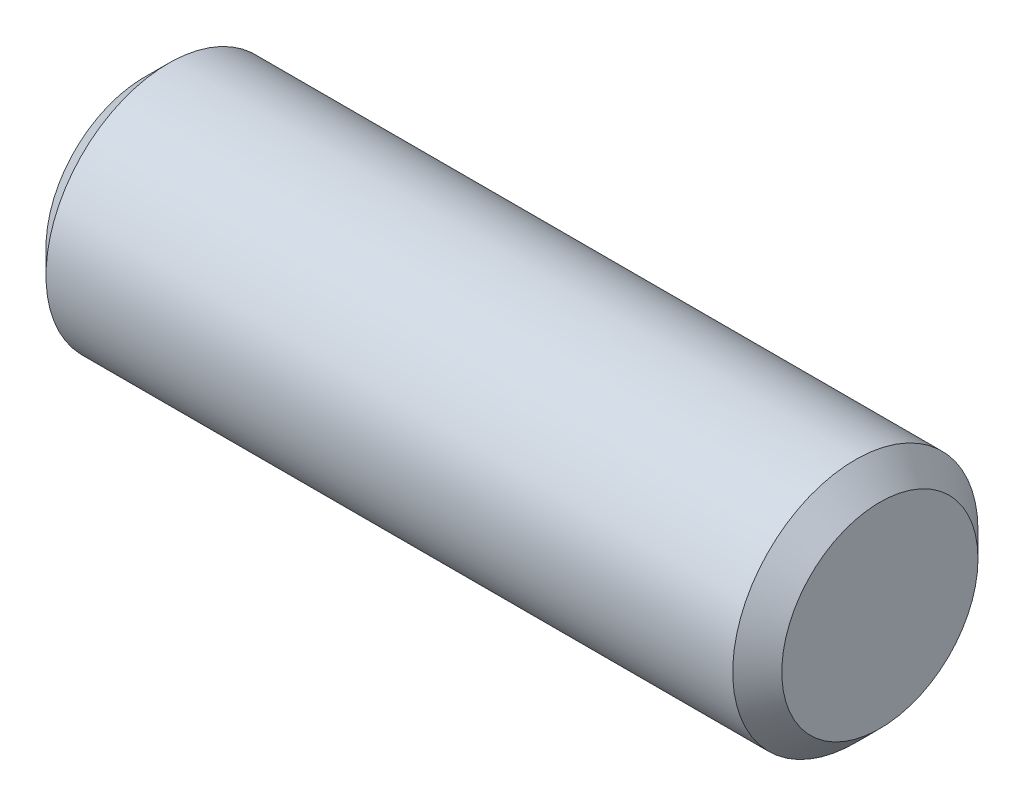
ISO-10303-21;
HEADER;
FILE_DESCRIPTION(('STEP AP214'),'2;1');
FILE_NAME('part.step','',(''),(''),'','','');
FILE_SCHEMA(('AUTOMOTIVE_DESIGN { 1 0 10303 214 1 1 1 1 }'));
ENDSEC;
DATA;
#1=APPLICATION_CONTEXT('core data for automotive mechanical design processes');
#2=APPLICATION_PROTOCOL_DEFINITION('international standard','automotive_design',2000,#1);
#3=PRODUCT_CONTEXT('',#1,'mechanical');
#4=PRODUCT('Part','Part','',(#3));
#5=PRODUCT_RELATED_PRODUCT_CATEGORY('part','',(#4));
#6=PRODUCT_DEFINITION_FORMATION('','',#4);
#7=PRODUCT_DEFINITION_CONTEXT('part definition',#1,'design');
#8=PRODUCT_DEFINITION('design','',#6,#7);
#9=PRODUCT_DEFINITION_SHAPE('','',#8);
#10=(LENGTH_UNIT() NAMED_UNIT(*) SI_UNIT(.MILLI.,.METRE.));
#11=(NAMED_UNIT(*) PLANE_ANGLE_UNIT() SI_UNIT($,.RADIAN.));
#12=(NAMED_UNIT(*) SI_UNIT($,.STERADIAN.) SOLID_ANGLE_UNIT());
#13=UNCERTAINTY_MEASURE_WITH_UNIT(LENGTH_MEASURE(1.E-05),#10,'distance_accuracy_value','');
#14=(GEOMETRIC_REPRESENTATION_CONTEXT(3) GLOBAL_UNCERTAINTY_ASSIGNED_CONTEXT((#13)) GLOBAL_UNIT_ASSIGNED_CONTEXT((#10,
#11,#12)) REPRESENTATION_CONTEXT('',''));
#15=CARTESIAN_POINT('',(0.,0.,0.));
#16=DIRECTION('',(0.,0.,1.));
#17=DIRECTION('',(1.,0.,0.));
#18=AXIS2_PLACEMENT_3D('',#15,#16,#17);
#19=CARTESIAN_POINT('',(-1.190625,0.,0.));
#20=DIRECTION('',(1.,0.,0.));
#21=DIRECTION('',(0.,0.,-1.));
#22=AXIS2_PLACEMENT_3D('',#19,#20,#21);
#23=CYLINDRICAL_SURFACE('',#22,0.396875);
#24=CARTESIAN_POINT('',(1.11125,0.,0.));
#25=DIRECTION('',(1.,0.,0.));
#26=DIRECTION('',(0.,0.,-1.));
#27=AXIS2_PLACEMENT_3D('',#24,#25,#26);
#28=CIRCLE('',#27,0.396875);
#29=CARTESIAN_POINT('',(1.11125,0.,-0.396875));
#30=VERTEX_POINT('',#29);
#31=EDGE_CURVE('E48',#30,#30,#28,.F.);
#32=ORIENTED_EDGE('',*,*,#31,.T.);
#33=EDGE_LOOP('',(#32));
#34=FACE_BOUND('',#33,.T.);
#35=CARTESIAN_POINT('',(-1.11125,0.,0.));
#36=DIRECTION('',(1.,0.,0.));
#37=DIRECTION('',(0.,0.,-1.));
#38=AXIS2_PLACEMENT_3D('',#35,#36,#37);
#39=CIRCLE('',#38,0.396875);
#40=CARTESIAN_POINT('',(-1.11125,0.,-0.396875));
#41=VERTEX_POINT('',#40);
#42=EDGE_CURVE('E53',#41,#41,#39,.T.);
#43=ORIENTED_EDGE('',*,*,#42,.T.);
#44=EDGE_LOOP('',(#43));
#45=FACE_BOUND('',#44,.T.);
#46=ADVANCED_FACE('F40',(#34,#45),#23,.T.);
#47=CARTESIAN_POINT('',(-1.190625,0.,0.));
#48=DIRECTION('',(1.,0.,0.));
#49=DIRECTION('',(0.,0.,-1.));
#50=AXIS2_PLACEMENT_3D('',#47,#48,#49);
#51=PLANE('',#50);
#52=CARTESIAN_POINT('',(-1.190625,0.,0.));
#53=DIRECTION('',(1.,0.,0.));
#54=DIRECTION('',(0.,0.,-1.));
#55=AXIS2_PLACEMENT_3D('',#52,#53,#54);
#56=CIRCLE('',#55,0.317499999999999);
#57=CARTESIAN_POINT('',(-1.190625,0.,-0.317499999999999));
#58=VERTEX_POINT('',#57);
#59=EDGE_CURVE('E10',#58,#58,#56,.F.);
#60=ORIENTED_EDGE('',*,*,#59,.T.);
#61=EDGE_LOOP('',(#60));
#62=FACE_BOUND('',#61,.T.);
#63=ADVANCED_FACE('F75',(#62),#51,.F.);
#64=CARTESIAN_POINT('',(1.190625,0.,0.));
#65=DIRECTION('',(1.,0.,0.));
#66=DIRECTION('',(0.,0.,-1.));
#67=AXIS2_PLACEMENT_3D('',#64,#65,#66);
#68=PLANE('',#67);
#69=CARTESIAN_POINT('',(1.190625,0.,0.));
#70=DIRECTION('',(1.,0.,0.));
#71=DIRECTION('',(0.,0.,-1.));
#72=AXIS2_PLACEMENT_3D('',#69,#70,#71);
#73=CIRCLE('',#72,0.317499999999999);
#74=CARTESIAN_POINT('',(1.190625,0.,-0.317499999999999));
#75=VERTEX_POINT('',#74);
#76=EDGE_CURVE('E58',#75,#75,#73,.T.);
#77=ORIENTED_EDGE('',*,*,#76,.T.);
#78=EDGE_LOOP('',(#77));
#79=FACE_BOUND('',#78,.T.);
#80=ADVANCED_FACE('F65',(#79),#68,.T.);
#81=CARTESIAN_POINT('',(1.190625,0.,0.));
#82=DIRECTION('',(-1.,0.,0.));
#83=DIRECTION('',(0.,0.,1.));
#84=AXIS2_PLACEMENT_3D('',#81,#82,#83);
#85=CONICAL_SURFACE('',#84,0.317499999999999,0.785398163397447);
#86=ORIENTED_EDGE('',*,*,#31,.F.);
#87=EDGE_LOOP('',(#86));
#88=FACE_BOUND('',#87,.T.);
#89=ORIENTED_EDGE('',*,*,#76,.F.);
#90=EDGE_LOOP('',(#89));
#91=FACE_BOUND('',#90,.T.);
#92=ADVANCED_FACE('F67',(#88,#91),#85,.T.);
#93=CARTESIAN_POINT('',(-1.11125,0.,0.));
#94=DIRECTION('',(1.,0.,0.));
#95=DIRECTION('',(0.,0.,-1.));
#96=AXIS2_PLACEMENT_3D('',#93,#94,#95);
#97=CONICAL_SURFACE('',#96,0.396875,0.785398163397451);
#98=ORIENTED_EDGE('',*,*,#59,.F.);
#99=EDGE_LOOP('',(#98));
#100=FACE_BOUND('',#99,.T.);
#101=ORIENTED_EDGE('',*,*,#42,.F.);
#102=EDGE_LOOP('',(#101));
#103=FACE_BOUND('',#102,.T.);
#104=ADVANCED_FACE('F42',(#100,#103),#97,.T.);
#105=CLOSED_SHELL('',(#46,#63,#80,#92,#104));
#106=MANIFOLD_SOLID_BREP('B2',#105);
#107=ADVANCED_BREP_SHAPE_REPRESENTATION('',(#18,#106),#14);
#108=SHAPE_DEFINITION_REPRESENTATION(#9,#107);
ENDSEC;
END-ISO-10303-21;
